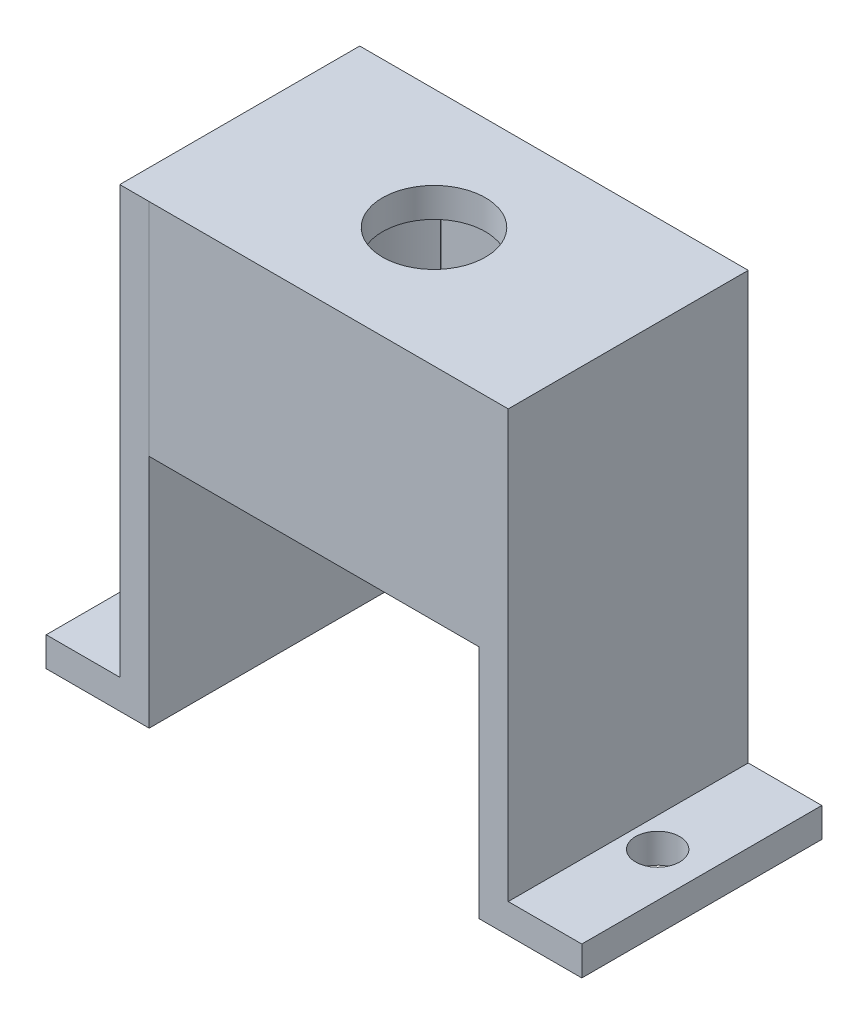
ISO-10303-21;
HEADER;
FILE_DESCRIPTION(('STEP AP214'),'2;1');
FILE_NAME('part.step','',(''),(''),'','','');
FILE_SCHEMA(('AUTOMOTIVE_DESIGN { 1 0 10303 214 1 1 1 1 }'));
ENDSEC;
DATA;
#1=APPLICATION_CONTEXT('core data for automotive mechanical design processes');
#2=APPLICATION_PROTOCOL_DEFINITION('international standard','automotive_design',2000,#1);
#3=PRODUCT_CONTEXT('',#1,'mechanical');
#4=PRODUCT('Part','Part','',(#3));
#5=PRODUCT_RELATED_PRODUCT_CATEGORY('part','',(#4));
#6=PRODUCT_DEFINITION_FORMATION('','',#4);
#7=PRODUCT_DEFINITION_CONTEXT('part definition',#1,'design');
#8=PRODUCT_DEFINITION('design','',#6,#7);
#9=PRODUCT_DEFINITION_SHAPE('','',#8);
#10=(LENGTH_UNIT() NAMED_UNIT(*) SI_UNIT(.MILLI.,.METRE.));
#11=(NAMED_UNIT(*) PLANE_ANGLE_UNIT() SI_UNIT($,.RADIAN.));
#12=(NAMED_UNIT(*) SI_UNIT($,.STERADIAN.) SOLID_ANGLE_UNIT());
#13=UNCERTAINTY_MEASURE_WITH_UNIT(LENGTH_MEASURE(1.E-05),#10,'distance_accuracy_value','');
#14=(GEOMETRIC_REPRESENTATION_CONTEXT(3) GLOBAL_UNCERTAINTY_ASSIGNED_CONTEXT((#13)) GLOBAL_UNIT_ASSIGNED_CONTEXT((#10,
#11,#12)) REPRESENTATION_CONTEXT('',''));
#15=CARTESIAN_POINT('',(0.,0.,0.));
#16=DIRECTION('',(0.,0.,1.));
#17=DIRECTION('',(1.,0.,0.));
#18=AXIS2_PLACEMENT_3D('',#15,#16,#17);
#19=CARTESIAN_POINT('',(-28.4728795445072,-3.,0.));
#20=DIRECTION('',(1.,0.,0.));
#21=DIRECTION('',(0.,0.,-1.));
#22=AXIS2_PLACEMENT_3D('',#19,#20,#21);
#23=PLANE('',#22);
#24=DIRECTION('',(0.,1.,0.));
#25=VECTOR('',#24,1.);
#26=CARTESIAN_POINT('',(-28.4728795445072,12.,6.36945204504964));
#27=LINE('',#26,#25);
#28=CARTESIAN_POINT('',(-28.4728795445072,-3.,6.36945204504964));
#29=VERTEX_POINT('',#28);
#30=CARTESIAN_POINT('',(-28.4728795445072,12.,6.36945204504964));
#31=VERTEX_POINT('',#30);
#32=EDGE_CURVE('E11',#29,#31,#27,.T.);
#33=ORIENTED_EDGE('',*,*,#32,.F.);
#34=DIRECTION('',(0.,0.,-1.));
#35=VECTOR('',#34,1.);
#36=CARTESIAN_POINT('',(-28.4728795445072,-3.,0.));
#37=LINE('',#36,#35);
#38=CARTESIAN_POINT('',(-28.4728795445072,-3.,6.37159662315022));
#39=VERTEX_POINT('',#38);
#40=EDGE_CURVE('E509',#39,#29,#37,.T.);
#41=ORIENTED_EDGE('',*,*,#40,.F.);
#42=DIRECTION('',(0.,1.,0.));
#43=VECTOR('',#42,1.);
#44=CARTESIAN_POINT('',(-28.4728795445072,-3.,6.37159662315022));
#45=LINE('',#44,#43);
#46=CARTESIAN_POINT('',(-28.4728795445072,12.,6.37159662315022));
#47=VERTEX_POINT('',#46);
#48=EDGE_CURVE('E519',#39,#47,#45,.T.);
#49=ORIENTED_EDGE('',*,*,#48,.T.);
#50=DIRECTION('',(0.,0.,-1.));
#51=VECTOR('',#50,1.);
#52=CARTESIAN_POINT('',(-28.4728795445072,12.,0.));
#53=LINE('',#52,#51);
#54=EDGE_CURVE('E532',#47,#31,#53,.T.);
#55=ORIENTED_EDGE('',*,*,#54,.T.);
#56=EDGE_LOOP('',(#33,#41,#49,#55));
#57=FACE_BOUND('',#56,.T.);
#58=ADVANCED_FACE('F47',(#57),#23,.F.);
#59=CARTESIAN_POINT('',(0.,0.,0.));
#60=DIRECTION('',(0.,1.,0.));
#61=DIRECTION('',(0.,0.,1.));
#62=AXIS2_PLACEMENT_3D('',#59,#60,#61);
#63=PLANE('',#62);
#64=CARTESIAN_POINT('',(-10.280448772951,0.,5.75981248715435));
#65=DIRECTION('',(0.,1.,0.));
#66=DIRECTION('',(0.,0.,1.));
#67=AXIS2_PLACEMENT_3D('',#64,#65,#66);
#68=CIRCLE('',#67,0.000681012910450294);
#69=CARTESIAN_POINT('',(-10.2809178123792,0.,5.75931874572508));
#70=VERTEX_POINT('',#69);
#71=CARTESIAN_POINT('',(-10.2811297856983,0.,5.75981201587057));
#72=VERTEX_POINT('',#71);
#73=EDGE_CURVE('E411',#70,#72,#68,.T.);
#74=ORIENTED_EDGE('',*,*,#73,.F.);
#75=CARTESIAN_POINT('',(-17.4169270645186,0.,-1.7525090358387));
#76=DIRECTION('',(0.,1.,0.));
#77=DIRECTION('',(0.,0.,1.));
#78=AXIS2_PLACEMENT_3D('',#75,#76,#77);
#79=CIRCLE('',#78,10.3609934208305);
#80=CARTESIAN_POINT('',(-10.2803968165551,0.,5.75882378107173));
#81=VERTEX_POINT('',#80);
#82=EDGE_CURVE('E368',#70,#81,#79,.T.);
#83=ORIENTED_EDGE('',*,*,#82,.T.);
#84=CARTESIAN_POINT('',(-10.2710154859666,0.,5.75981248715435));
#85=DIRECTION('',(0.,1.,0.));
#86=DIRECTION('',(0.,0.,1.));
#87=AXIS2_PLACEMENT_3D('',#84,#85,#86);
#88=CIRCLE('',#87,0.00943328698438707);
#89=CARTESIAN_POINT('',(-10.280448772951,0.,5.75981248715435));
#90=VERTEX_POINT('',#89);
#91=EDGE_CURVE('E512',#81,#90,#88,.T.);
#92=ORIENTED_EDGE('',*,*,#91,.T.);
#93=DIRECTION('',(1.,0.,0.));
#94=VECTOR('',#93,1.);
#95=CARTESIAN_POINT('',(0.,0.,5.75981248715435));
#96=LINE('',#95,#94);
#97=EDGE_CURVE('E469',#72,#90,#96,.T.);
#98=ORIENTED_EDGE('',*,*,#97,.F.);
#99=EDGE_LOOP('',(#74,#83,#92,#98));
#100=FACE_BOUND('',#99,.T.);
#101=ADVANCED_FACE('F647',(#100),#63,.F.);
#102=CARTESIAN_POINT('',(0.,12.,0.));
#103=DIRECTION('',(0.,1.,0.));
#104=DIRECTION('',(0.,0.,1.));
#105=AXIS2_PLACEMENT_3D('',#102,#103,#104);
#106=PLANE('',#105);
#107=CARTESIAN_POINT('',(-17.2694265241894,12.,-1.78447566590007));
#108=DIRECTION('',(0.,1.,0.));
#109=DIRECTION('',(0.,0.,1.));
#110=AXIS2_PLACEMENT_3D('',#107,#108,#109);
#111=CIRCLE('',#110,3.5);
#112=CARTESIAN_POINT('',(-17.2694265241894,12.,1.71552433409993));
#113=VERTEX_POINT('',#112);
#114=EDGE_CURVE('E249',#113,#113,#111,.T.);
#115=ORIENTED_EDGE('',*,*,#114,.F.);
#116=EDGE_LOOP('',(#115));
#117=FACE_BOUND('',#116,.T.);
#118=DIRECTION('',(1.,0.,0.));
#119=VECTOR('',#118,1.);
#120=CARTESIAN_POINT('',(0.,12.,6.37159662315022));
#121=LINE('',#120,#119);
#122=CARTESIAN_POINT('',(-4.06597350387149,12.,6.37159662315022));
#123=VERTEX_POINT('',#122);
#124=EDGE_CURVE('E442',#47,#123,#121,.T.);
#125=ORIENTED_EDGE('',*,*,#124,.T.);
#126=DIRECTION('',(0.,0.,1.));
#127=VECTOR('',#126,1.);
#128=CARTESIAN_POINT('',(-4.06597350387149,12.,6.37159662315022));
#129=LINE('',#128,#127);
#130=CARTESIAN_POINT('',(-4.06597350387149,12.,-9.94054795495036));
#131=VERTEX_POINT('',#130);
#132=EDGE_CURVE('E316',#131,#123,#129,.T.);
#133=ORIENTED_EDGE('',*,*,#132,.F.);
#134=DIRECTION('',(1.,0.,0.));
#135=VECTOR('',#134,1.);
#136=CARTESIAN_POINT('',(0.,12.,-9.94054795495036));
#137=LINE('',#136,#135);
#138=CARTESIAN_POINT('',(-30.4728795445072,12.,-9.94054795495036));
#139=VERTEX_POINT('',#138);
#140=EDGE_CURVE('E588',#139,#131,#137,.T.);
#141=ORIENTED_EDGE('',*,*,#140,.F.);
#142=DIRECTION('',(0.,0.,-1.));
#143=VECTOR('',#142,1.);
#144=CARTESIAN_POINT('',(-30.4728795445072,12.,-9.94054795495036));
#145=LINE('',#144,#143);
#146=CARTESIAN_POINT('',(-30.4728795445072,12.,6.36945204504964));
#147=VERTEX_POINT('',#146);
#148=EDGE_CURVE('E342',#147,#139,#145,.T.);
#149=ORIENTED_EDGE('',*,*,#148,.F.);
#150=DIRECTION('',(1.,0.,0.));
#151=VECTOR('',#150,1.);
#152=CARTESIAN_POINT('',(-30.4728795445072,12.,6.36945204504964));
#153=LINE('',#152,#151);
#154=EDGE_CURVE('E346',#147,#31,#153,.T.);
#155=ORIENTED_EDGE('',*,*,#154,.T.);
#156=ORIENTED_EDGE('',*,*,#54,.F.);
#157=EDGE_LOOP('',(#125,#133,#141,#149,#155,#156));
#158=FACE_BOUND('',#157,.T.);
#159=ADVANCED_FACE('F600',(#117,#158),#106,.T.);
#160=CARTESIAN_POINT('',(-10.2710154859666,-3.,5.75981248715435));
#161=DIRECTION('',(0.,1.,0.));
#162=DIRECTION('',(0.,0.,1.));
#163=AXIS2_PLACEMENT_3D('',#160,#161,#162);
#164=CYLINDRICAL_SURFACE('',#163,0.00943328698438707);
#165=DIRECTION('',(0.,1.,0.));
#166=VECTOR('',#165,1.);
#167=CARTESIAN_POINT('',(-10.280448772951,-3.,5.75981248715435));
#168=LINE('',#167,#166);
#169=CARTESIAN_POINT('',(-10.280448772951,-3.,5.75981248715435));
#170=VERTEX_POINT('',#169);
#171=EDGE_CURVE('E503',#170,#90,#168,.T.);
#172=ORIENTED_EDGE('',*,*,#171,.T.);
#173=ORIENTED_EDGE('',*,*,#91,.F.);
#174=CARTESIAN_POINT('',(-10.2776048785716,0.,5.75306216801915));
#175=VERTEX_POINT('',#174);
#176=EDGE_CURVE('E510',#175,#81,#88,.T.);
#177=ORIENTED_EDGE('',*,*,#176,.F.);
#178=DIRECTION('',(0.,1.,0.));
#179=VECTOR('',#178,1.);
#180=CARTESIAN_POINT('',(-10.2776048785716,-3.,5.75306216801915));
#181=LINE('',#180,#179);
#182=CARTESIAN_POINT('',(-10.2776048785716,-3.,5.75306216801915));
#183=VERTEX_POINT('',#182);
#184=EDGE_CURVE('E523',#183,#175,#181,.T.);
#185=ORIENTED_EDGE('',*,*,#184,.F.);
#186=CARTESIAN_POINT('',(-10.2710154859666,-3.,5.75981248715435));
#187=DIRECTION('',(0.,1.,0.));
#188=DIRECTION('',(0.,0.,1.));
#189=AXIS2_PLACEMENT_3D('',#186,#187,#188);
#190=CIRCLE('',#189,0.00943328698438707);
#191=EDGE_CURVE('E554',#170,#183,#190,.F.);
#192=ORIENTED_EDGE('',*,*,#191,.F.);
#193=EDGE_LOOP('',(#172,#173,#177,#185,#192));
#194=FACE_BOUND('',#193,.T.);
#195=ADVANCED_FACE('F552',(#194),#164,.T.);
#196=CARTESIAN_POINT('',(-17.5943756456062,-3.,-1.74239920107681));
#197=DIRECTION('',(0.,1.,0.));
#198=DIRECTION('',(0.,0.,1.));
#199=AXIS2_PLACEMENT_3D('',#196,#197,#198);
#200=CYLINDRICAL_SURFACE('',#199,10.4745919057948);
#201=ORIENTED_EDGE('',*,*,#184,.T.);
#202=CARTESIAN_POINT('',(-17.5943756456062,0.,-1.74239920107681));
#203=DIRECTION('',(0.,1.,0.));
#204=DIRECTION('',(0.,0.,1.));
#205=AXIS2_PLACEMENT_3D('',#202,#203,#204);
#206=CIRCLE('',#205,10.4745919057948);
#207=CARTESIAN_POINT('',(-10.273080285058,0.,-9.23344117376381));
#208=VERTEX_POINT('',#207);
#209=EDGE_CURVE('E457',#175,#208,#206,.T.);
#210=ORIENTED_EDGE('',*,*,#209,.T.);
#211=DIRECTION('',(0.,1.,0.));
#212=VECTOR('',#211,1.);
#213=CARTESIAN_POINT('',(-10.273080285058,-3.,-9.23344117376381));
#214=LINE('',#213,#212);
#215=CARTESIAN_POINT('',(-10.273080285058,-3.,-9.23344117376381));
#216=VERTEX_POINT('',#215);
#217=EDGE_CURVE('E501',#216,#208,#214,.T.);
#218=ORIENTED_EDGE('',*,*,#217,.F.);
#219=CARTESIAN_POINT('',(-17.5943756456062,-3.,-1.74239920107681));
#220=DIRECTION('',(0.,1.,0.));
#221=DIRECTION('',(0.,0.,1.));
#222=AXIS2_PLACEMENT_3D('',#219,#220,#221);
#223=CIRCLE('',#222,10.4745919057948);
#224=EDGE_CURVE('E547',#183,#216,#223,.T.);
#225=ORIENTED_EDGE('',*,*,#224,.F.);
#226=EDGE_LOOP('',(#201,#210,#218,#225));
#227=FACE_BOUND('',#226,.T.);
#228=ADVANCED_FACE('F546',(#227),#200,.F.);
#229=CARTESIAN_POINT('',(-0.00193654345881467,-3.,-9.23559485379658));
#230=DIRECTION('',(-0.000209682586438576,0.,-0.999999978016606));
#231=DIRECTION('',(-0.999999978016606,0.,0.000209682586438576));
#232=AXIS2_PLACEMENT_3D('',#229,#230,#231);
#233=PLANE('',#232);
#234=ORIENTED_EDGE('',*,*,#217,.T.);
#235=DIRECTION('',(0.999999978016606,0.,-0.000209682586438576));
#236=VECTOR('',#235,1.);
#237=CARTESIAN_POINT('',(-0.00193654345881467,0.,-9.23559485379658));
#238=LINE('',#237,#236);
#239=CARTESIAN_POINT('',(-24.2455208864717,0.,-9.23051389621505));
#240=VERTEX_POINT('',#239);
#241=EDGE_CURVE('E452',#240,#208,#238,.T.);
#242=ORIENTED_EDGE('',*,*,#241,.F.);
#243=CARTESIAN_POINT('',(-24.2700173864249,0.,-9.23050625972566));
#244=VERTEX_POINT('',#243);
#245=EDGE_CURVE('E456',#244,#240,#238,.T.);
#246=ORIENTED_EDGE('',*,*,#245,.F.);
#247=DIRECTION('',(0.,1.,0.));
#248=VECTOR('',#247,1.);
#249=CARTESIAN_POINT('',(-24.2700173864249,-3.,-9.23050625972566));
#250=LINE('',#249,#248);
#251=CARTESIAN_POINT('',(-24.2700173864249,-3.,-9.23050625972566));
#252=VERTEX_POINT('',#251);
#253=EDGE_CURVE('E496',#252,#244,#250,.T.);
#254=ORIENTED_EDGE('',*,*,#253,.F.);
#255=DIRECTION('',(-0.999999978016606,0.,0.000209682586438576));
#256=VECTOR('',#255,1.);
#257=CARTESIAN_POINT('',(-0.00193654345881467,-3.,-9.23559485379658));
#258=LINE('',#257,#256);
#259=EDGE_CURVE('E544',#216,#252,#258,.T.);
#260=ORIENTED_EDGE('',*,*,#259,.F.);
#261=EDGE_LOOP('',(#234,#242,#246,#254,#260));
#262=FACE_BOUND('',#261,.T.);
#263=ADVANCED_FACE('F540',(#262),#233,.F.);
#264=CARTESIAN_POINT('',(-17.4292056032931,-3.,-1.74018751284565));
#265=DIRECTION('',(0.,1.,0.));
#266=DIRECTION('',(0.,0.,1.));
#267=AXIS2_PLACEMENT_3D('',#264,#265,#266);
#268=CYLINDRICAL_SURFACE('',#267,10.1440416394106);
#269=ORIENTED_EDGE('',*,*,#253,.T.);
#270=CARTESIAN_POINT('',(-17.4292056032931,0.,-1.74018751284565));
#271=DIRECTION('',(0.,1.,0.));
#272=DIRECTION('',(0.,0.,1.));
#273=AXIS2_PLACEMENT_3D('',#270,#271,#272);
#274=CIRCLE('',#273,10.1440416394106);
#275=CARTESIAN_POINT('',(-24.2700173864248,0.,5.75013123403436));
#276=VERTEX_POINT('',#275);
#277=EDGE_CURVE('E463',#244,#276,#274,.T.);
#278=ORIENTED_EDGE('',*,*,#277,.T.);
#279=DIRECTION('',(0.,1.,0.));
#280=VECTOR('',#279,1.);
#281=CARTESIAN_POINT('',(-24.2700173864248,-3.,5.75013123403436));
#282=LINE('',#281,#280);
#283=CARTESIAN_POINT('',(-24.2700173864248,-3.,5.75013123403436));
#284=VERTEX_POINT('',#283);
#285=EDGE_CURVE('E491',#284,#276,#282,.T.);
#286=ORIENTED_EDGE('',*,*,#285,.F.);
#287=CARTESIAN_POINT('',(-17.4292056032931,-3.,-1.74018751284565));
#288=DIRECTION('',(0.,1.,0.));
#289=DIRECTION('',(0.,0.,1.));
#290=AXIS2_PLACEMENT_3D('',#287,#288,#289);
#291=CIRCLE('',#290,10.1440416394106);
#292=EDGE_CURVE('E561',#252,#284,#291,.T.);
#293=ORIENTED_EDGE('',*,*,#292,.F.);
#294=EDGE_LOOP('',(#269,#278,#286,#293));
#295=FACE_BOUND('',#294,.T.);
#296=ADVANCED_FACE('F665',(#295),#268,.F.);
#297=CARTESIAN_POINT('',(-24.2788591503947,-3.,5.75981248715435));
#298=DIRECTION('',(0.,1.,0.));
#299=DIRECTION('',(0.,0.,1.));
#300=AXIS2_PLACEMENT_3D('',#297,#298,#299);
#301=CYLINDRICAL_SURFACE('',#300,0.0131111956766548);
#302=ORIENTED_EDGE('',*,*,#285,.T.);
#303=CARTESIAN_POINT('',(-24.2788591503947,0.,5.75981248715435));
#304=DIRECTION('',(0.,1.,0.));
#305=DIRECTION('',(0.,0.,1.));
#306=AXIS2_PLACEMENT_3D('',#303,#304,#305);
#307=CIRCLE('',#306,0.0131111956766548);
#308=CARTESIAN_POINT('',(-24.265747954718,0.,5.75981248715435));
#309=VERTEX_POINT('',#308);
#310=EDGE_CURVE('E467',#309,#276,#307,.T.);
#311=ORIENTED_EDGE('',*,*,#310,.F.);
#312=DIRECTION('',(0.,1.,0.));
#313=VECTOR('',#312,1.);
#314=CARTESIAN_POINT('',(-24.265747954718,-3.,5.75981248715435));
#315=LINE('',#314,#313);
#316=CARTESIAN_POINT('',(-24.265747954718,-3.,5.75981248715435));
#317=VERTEX_POINT('',#316);
#318=EDGE_CURVE('E483',#317,#309,#315,.T.);
#319=ORIENTED_EDGE('',*,*,#318,.F.);
#320=CARTESIAN_POINT('',(-24.2788591503947,-3.,5.75981248715435));
#321=DIRECTION('',(0.,1.,0.));
#322=DIRECTION('',(0.,0.,1.));
#323=AXIS2_PLACEMENT_3D('',#320,#321,#322);
#324=CIRCLE('',#323,0.0131111956766548);
#325=EDGE_CURVE('E492',#284,#317,#324,.F.);
#326=ORIENTED_EDGE('',*,*,#325,.F.);
#327=EDGE_LOOP('',(#302,#311,#319,#326));
#328=FACE_BOUND('',#327,.T.);
#329=ADVANCED_FACE('F488',(#328),#301,.T.);
#330=CARTESIAN_POINT('',(0.,-3.,5.75981248715435));
#331=DIRECTION('',(0.,0.,1.));
#332=DIRECTION('',(1.,0.,0.));
#333=AXIS2_PLACEMENT_3D('',#330,#331,#332);
#334=PLANE('',#333);
#335=ORIENTED_EDGE('',*,*,#318,.T.);
#336=EDGE_CURVE('E57',#309,#72,#96,.T.);
#337=ORIENTED_EDGE('',*,*,#336,.T.);
#338=ORIENTED_EDGE('',*,*,#97,.T.);
#339=ORIENTED_EDGE('',*,*,#171,.F.);
#340=DIRECTION('',(1.,0.,0.));
#341=VECTOR('',#340,1.);
#342=CARTESIAN_POINT('',(0.,-3.,5.75981248715435));
#343=LINE('',#342,#341);
#344=EDGE_CURVE('E555',#317,#170,#343,.T.);
#345=ORIENTED_EDGE('',*,*,#344,.F.);
#346=EDGE_LOOP('',(#335,#337,#338,#339,#345));
#347=FACE_BOUND('',#346,.T.);
#348=ADVANCED_FACE('F480',(#347),#334,.F.);
#349=CARTESIAN_POINT('',(0.,-3.,6.37159662315022));
#350=DIRECTION('',(0.,0.,1.));
#351=DIRECTION('',(1.,0.,0.));
#352=AXIS2_PLACEMENT_3D('',#349,#350,#351);
#353=PLANE('',#352);
#354=ORIENTED_EDGE('',*,*,#124,.F.);
#355=ORIENTED_EDGE('',*,*,#48,.F.);
#356=DIRECTION('',(1.,0.,0.));
#357=VECTOR('',#356,1.);
#358=CARTESIAN_POINT('',(0.,-3.,6.37159662315022));
#359=LINE('',#358,#357);
#360=CARTESIAN_POINT('',(-6.06597350387149,-3.,6.37159662315022));
#361=VERTEX_POINT('',#360);
#362=EDGE_CURVE('E572',#39,#361,#359,.T.);
#363=ORIENTED_EDGE('',*,*,#362,.T.);
#364=DIRECTION('',(0.,-1.,0.));
#365=VECTOR('',#364,1.);
#366=CARTESIAN_POINT('',(-6.06597350387149,12.,6.37159662315022));
#367=LINE('',#366,#365);
#368=CARTESIAN_POINT('',(-6.06597350387149,-19.,6.37159662315022));
#369=VERTEX_POINT('',#368);
#370=EDGE_CURVE('E308',#361,#369,#367,.T.);
#371=ORIENTED_EDGE('',*,*,#370,.T.);
#372=DIRECTION('',(-1.,0.,0.));
#373=VECTOR('',#372,1.);
#374=CARTESIAN_POINT('',(-4.06597350387149,-19.,6.37159662315022));
#375=LINE('',#374,#373);
#376=CARTESIAN_POINT('',(0.934026496128512,-19.,6.37159662315022));
#377=VERTEX_POINT('',#376);
#378=EDGE_CURVE('E332',#377,#369,#375,.T.);
#379=ORIENTED_EDGE('',*,*,#378,.F.);
#380=DIRECTION('',(0.,-1.,0.));
#381=VECTOR('',#380,1.);
#382=CARTESIAN_POINT('',(0.934026496128512,-19.,6.37159662315022));
#383=LINE('',#382,#381);
#384=CARTESIAN_POINT('',(0.934026496128512,-17.,6.37159662315022));
#385=VERTEX_POINT('',#384);
#386=EDGE_CURVE('E284',#385,#377,#383,.T.);
#387=ORIENTED_EDGE('',*,*,#386,.F.);
#388=DIRECTION('',(-1.,0.,0.));
#389=VECTOR('',#388,1.);
#390=CARTESIAN_POINT('',(0.934026496128512,-17.,6.37159662315022));
#391=LINE('',#390,#389);
#392=CARTESIAN_POINT('',(-4.06597350387149,-17.,6.37159662315022));
#393=VERTEX_POINT('',#392);
#394=EDGE_CURVE('E298',#385,#393,#391,.T.);
#395=ORIENTED_EDGE('',*,*,#394,.T.);
#396=DIRECTION('',(0.,-1.,0.));
#397=VECTOR('',#396,1.);
#398=CARTESIAN_POINT('',(-4.06597350387149,12.,6.37159662315022));
#399=LINE('',#398,#397);
#400=EDGE_CURVE('E309',#123,#393,#399,.T.);
#401=ORIENTED_EDGE('',*,*,#400,.F.);
#402=EDGE_LOOP('',(#354,#355,#363,#371,#379,#387,#395,#401));
#403=FACE_BOUND('',#402,.T.);
#404=ADVANCED_FACE('F619',(#403),#353,.T.);
#405=CARTESIAN_POINT('',(0.,-3.,-9.94054795495036));
#406=DIRECTION('',(0.,0.,1.));
#407=DIRECTION('',(1.,0.,0.));
#408=AXIS2_PLACEMENT_3D('',#405,#406,#407);
#409=PLANE('',#408);
#410=ORIENTED_EDGE('',*,*,#140,.T.);
#411=DIRECTION('',(0.,1.,0.));
#412=VECTOR('',#411,1.);
#413=CARTESIAN_POINT('',(-4.06597350387149,12.,-9.94054795495036));
#414=LINE('',#413,#412);
#415=CARTESIAN_POINT('',(-4.06597350387149,-17.,-9.94054795495036));
#416=VERTEX_POINT('',#415);
#417=EDGE_CURVE('E312',#416,#131,#414,.T.);
#418=ORIENTED_EDGE('',*,*,#417,.F.);
#419=DIRECTION('',(-1.,0.,0.));
#420=VECTOR('',#419,1.);
#421=CARTESIAN_POINT('',(0.934026496128512,-17.,-9.94054795495036));
#422=LINE('',#421,#420);
#423=CARTESIAN_POINT('',(0.934026496128512,-17.,-9.94054795495036));
#424=VERTEX_POINT('',#423);
#425=EDGE_CURVE('E304',#424,#416,#422,.T.);
#426=ORIENTED_EDGE('',*,*,#425,.F.);
#427=DIRECTION('',(0.,1.,0.));
#428=VECTOR('',#427,1.);
#429=CARTESIAN_POINT('',(0.934026496128512,-19.,-9.94054795495036));
#430=LINE('',#429,#428);
#431=CARTESIAN_POINT('',(0.934026496128512,-19.,-9.94054795495036));
#432=VERTEX_POINT('',#431);
#433=EDGE_CURVE('E292',#432,#424,#430,.T.);
#434=ORIENTED_EDGE('',*,*,#433,.F.);
#435=DIRECTION('',(-1.,0.,0.));
#436=VECTOR('',#435,1.);
#437=CARTESIAN_POINT('',(-4.06597350387149,-19.,-9.94054795495036));
#438=LINE('',#437,#436);
#439=CARTESIAN_POINT('',(-6.06597350387149,-19.,-9.94054795495036));
#440=VERTEX_POINT('',#439);
#441=EDGE_CURVE('E320',#432,#440,#438,.T.);
#442=ORIENTED_EDGE('',*,*,#441,.T.);
#443=DIRECTION('',(0.,1.,0.));
#444=VECTOR('',#443,1.);
#445=CARTESIAN_POINT('',(-6.06597350387149,12.,-9.94054795495036));
#446=LINE('',#445,#444);
#447=CARTESIAN_POINT('',(-6.06597350387149,-3.,-9.94054795495036));
#448=VERTEX_POINT('',#447);
#449=EDGE_CURVE('E313',#440,#448,#446,.T.);
#450=ORIENTED_EDGE('',*,*,#449,.T.);
#451=DIRECTION('',(1.,0.,0.));
#452=VECTOR('',#451,1.);
#453=CARTESIAN_POINT('',(0.,-3.,-9.94054795495036));
#454=LINE('',#453,#452);
#455=CARTESIAN_POINT('',(-28.4728795445072,-3.,-9.94054795495036));
#456=VERTEX_POINT('',#455);
#457=EDGE_CURVE('E580',#456,#448,#454,.T.);
#458=ORIENTED_EDGE('',*,*,#457,.F.);
#459=DIRECTION('',(0.,-1.,0.));
#460=VECTOR('',#459,1.);
#461=CARTESIAN_POINT('',(-28.4728795445072,12.,-9.94054795495036));
#462=LINE('',#461,#460);
#463=CARTESIAN_POINT('',(-28.4728795445072,-19.,-9.94054795495036));
#464=VERTEX_POINT('',#463);
#465=EDGE_CURVE('E245',#456,#464,#462,.T.);
#466=ORIENTED_EDGE('',*,*,#465,.T.);
#467=DIRECTION('',(1.,0.,0.));
#468=VECTOR('',#467,1.);
#469=CARTESIAN_POINT('',(-30.4728795445072,-19.,-9.94054795495036));
#470=LINE('',#469,#468);
#471=CARTESIAN_POINT('',(-35.4728795445072,-19.,-9.94054795495036));
#472=VERTEX_POINT('',#471);
#473=EDGE_CURVE('E236',#472,#464,#470,.T.);
#474=ORIENTED_EDGE('',*,*,#473,.F.);
#475=DIRECTION('',(0.,-1.,0.));
#476=VECTOR('',#475,1.);
#477=CARTESIAN_POINT('',(-35.4728795445072,-19.,-9.94054795495036));
#478=LINE('',#477,#476);
#479=CARTESIAN_POINT('',(-35.4728795445072,-17.,-9.94054795495036));
#480=VERTEX_POINT('',#479);
#481=EDGE_CURVE('E242',#480,#472,#478,.T.);
#482=ORIENTED_EDGE('',*,*,#481,.F.);
#483=DIRECTION('',(1.,0.,0.));
#484=VECTOR('',#483,1.);
#485=CARTESIAN_POINT('',(-35.4728795445072,-17.,-9.94054795495036));
#486=LINE('',#485,#484);
#487=CARTESIAN_POINT('',(-30.4728795445072,-17.,-9.94054795495036));
#488=VERTEX_POINT('',#487);
#489=EDGE_CURVE('E276',#480,#488,#486,.T.);
#490=ORIENTED_EDGE('',*,*,#489,.T.);
#491=DIRECTION('',(0.,-1.,0.));
#492=VECTOR('',#491,1.);
#493=CARTESIAN_POINT('',(-30.4728795445072,12.,-9.94054795495036));
#494=LINE('',#493,#492);
#495=EDGE_CURVE('E336',#139,#488,#494,.T.);
#496=ORIENTED_EDGE('',*,*,#495,.F.);
#497=EDGE_LOOP('',(#410,#418,#426,#434,#442,#450,#458,#466,#474,#482,#490,#496));
#498=FACE_BOUND('',#497,.T.);
#499=ADVANCED_FACE('F239',(#498),#409,.F.);
#500=CARTESIAN_POINT('',(0.,-3.,0.));
#501=DIRECTION('',(0.,1.,0.));
#502=DIRECTION('',(0.,0.,1.));
#503=AXIS2_PLACEMENT_3D('',#500,#501,#502);
#504=PLANE('',#503);
#505=ORIENTED_EDGE('',*,*,#191,.T.);
#506=ORIENTED_EDGE('',*,*,#224,.T.);
#507=ORIENTED_EDGE('',*,*,#259,.T.);
#508=ORIENTED_EDGE('',*,*,#292,.T.);
#509=ORIENTED_EDGE('',*,*,#325,.T.);
#510=ORIENTED_EDGE('',*,*,#344,.T.);
#511=EDGE_LOOP('',(#505,#506,#507,#508,#509,#510));
#512=FACE_BOUND('',#511,.T.);
#513=ORIENTED_EDGE('',*,*,#362,.F.);
#514=ORIENTED_EDGE('',*,*,#40,.T.);
#515=EDGE_CURVE('E583',#29,#456,#37,.T.);
#516=ORIENTED_EDGE('',*,*,#515,.T.);
#517=ORIENTED_EDGE('',*,*,#457,.T.);
#518=DIRECTION('',(0.,0.,-1.));
#519=VECTOR('',#518,1.);
#520=CARTESIAN_POINT('',(-6.06597350387149,-3.,0.));
#521=LINE('',#520,#519);
#522=EDGE_CURVE('E576',#361,#448,#521,.T.);
#523=ORIENTED_EDGE('',*,*,#522,.F.);
#524=EDGE_LOOP('',(#513,#514,#516,#517,#523));
#525=FACE_BOUND('',#524,.T.);
#526=ADVANCED_FACE('F611',(#512,#525),#504,.F.);
#527=CARTESIAN_POINT('',(-24.2700173864248,0.,5.75013123403436));
#528=DIRECTION('',(0.,1.,0.));
#529=DIRECTION('',(0.,0.,1.));
#530=AXIS2_PLACEMENT_3D('',#527,#528,#529);
#531=CIRCLE('',#530,0.0244965021365407);
#532=CARTESIAN_POINT('',(-24.2455208901541,0.,5.75014818643564));
#533=VERTEX_POINT('',#532);
#534=CARTESIAN_POINT('',(-24.2534977420446,0.,5.73204311731434));
#535=VERTEX_POINT('',#534);
#536=EDGE_CURVE('E402',#533,#535,#531,.T.);
#537=ORIENTED_EDGE('',*,*,#536,.F.);
#538=DIRECTION('',(0.999999760544756,0.,0.000692033547942534));
#539=VECTOR('',#538,1.);
#540=CARTESIAN_POINT('',(-0.00399090593066213,0.,5.76692414245527));
#541=LINE('',#540,#539);
#542=EDGE_CURVE('E407',#533,#72,#541,.T.);
#543=ORIENTED_EDGE('',*,*,#542,.T.);
#544=ORIENTED_EDGE('',*,*,#336,.F.);
#545=ORIENTED_EDGE('',*,*,#310,.T.);
#546=ORIENTED_EDGE('',*,*,#277,.F.);
#547=ORIENTED_EDGE('',*,*,#245,.T.);
#548=CARTESIAN_POINT('',(-24.2700173864249,0.,-9.23050625972566));
#549=DIRECTION('',(0.,1.,0.));
#550=DIRECTION('',(0.,0.,1.));
#551=AXIS2_PLACEMENT_3D('',#548,#549,#550);
#552=CIRCLE('',#551,0.0244965021365407);
#553=CARTESIAN_POINT('',(-24.2534977420446,0.,-9.21241814300565));
#554=VERTEX_POINT('',#553);
#555=EDGE_CURVE('E403',#554,#240,#552,.T.);
#556=ORIENTED_EDGE('',*,*,#555,.F.);
#557=CARTESIAN_POINT('',(-17.4292056032911,0.,-1.74018751284566));
#558=DIRECTION('',(0.,1.,0.));
#559=DIRECTION('',(0.,0.,1.));
#560=AXIS2_PLACEMENT_3D('',#557,#558,#559);
#561=CIRCLE('',#560,10.1195451372754);
#562=EDGE_CURVE('E398',#554,#535,#561,.T.);
#563=ORIENTED_EDGE('',*,*,#562,.T.);
#564=EDGE_LOOP('',(#537,#543,#544,#545,#546,#547,#556,#563));
#565=FACE_BOUND('',#564,.T.);
#566=ADVANCED_FACE('F49',(#565),#63,.F.);
#567=CARTESIAN_POINT('',(0.,0.,0.));
#568=DIRECTION('',(0.,1.,0.));
#569=DIRECTION('',(0.,0.,1.));
#570=AXIS2_PLACEMENT_3D('',#567,#568,#569);
#571=PLANE('',#570);
#572=ORIENTED_EDGE('',*,*,#176,.T.);
#573=CARTESIAN_POINT('',(-10.2611524254198,0.,-9.2455107027892));
#574=VERTEX_POINT('',#573);
#575=EDGE_CURVE('E415',#81,#574,#79,.T.);
#576=ORIENTED_EDGE('',*,*,#575,.T.);
#577=CARTESIAN_POINT('',(-10.2606820868416,0.,-9.24600320680556));
#578=DIRECTION('',(0.,1.,0.));
#579=DIRECTION('',(0.,0.,1.));
#580=AXIS2_PLACEMENT_3D('',#577,#578,#579);
#581=CIRCLE('',#580,0.000681012910449594);
#582=CARTESIAN_POINT('',(-10.2613630993354,0.,-9.24600245347827));
#583=VERTEX_POINT('',#582);
#584=EDGE_CURVE('E393',#583,#574,#581,.T.);
#585=ORIENTED_EDGE('',*,*,#584,.F.);
#586=DIRECTION('',(-0.999999388175525,0.,0.00110618650115007));
#587=VECTOR('',#586,1.);
#588=CARTESIAN_POINT('',(-0.0102403531483553,0.,-9.25734211401961));
#589=LINE('',#588,#587);
#590=EDGE_CURVE('E397',#583,#240,#589,.T.);
#591=ORIENTED_EDGE('',*,*,#590,.T.);
#592=ORIENTED_EDGE('',*,*,#241,.T.);
#593=ORIENTED_EDGE('',*,*,#209,.F.);
#594=EDGE_LOOP('',(#572,#576,#585,#591,#592,#593));
#595=FACE_BOUND('',#594,.T.);
#596=ADVANCED_FACE('F550',(#595),#571,.T.);
#597=CARTESIAN_POINT('',(-10.2606820868416,10.,-9.24600320680556));
#598=DIRECTION('',(0.,-1.,0.));
#599=DIRECTION('',(0.,0.,-1.));
#600=AXIS2_PLACEMENT_3D('',#597,#598,#599);
#601=CYLINDRICAL_SURFACE('',#600,0.000681012910449594);
#602=ORIENTED_EDGE('',*,*,#584,.T.);
#603=DIRECTION('',(0.,-1.,0.));
#604=VECTOR('',#603,1.);
#605=CARTESIAN_POINT('',(-10.2611524254198,10.,-9.2455107027892));
#606=LINE('',#605,#604);
#607=CARTESIAN_POINT('',(-10.2611524254198,10.,-9.2455107027892));
#608=VERTEX_POINT('',#607);
#609=EDGE_CURVE('E392',#608,#574,#606,.T.);
#610=ORIENTED_EDGE('',*,*,#609,.F.);
#611=CARTESIAN_POINT('',(-10.2606820868416,10.,-9.24600320680556));
#612=DIRECTION('',(0.,1.,0.));
#613=DIRECTION('',(0.,0.,1.));
#614=AXIS2_PLACEMENT_3D('',#611,#612,#613);
#615=CIRCLE('',#614,0.000681012910449594);
#616=CARTESIAN_POINT('',(-10.2613630993354,10.,-9.24600245347827));
#617=VERTEX_POINT('',#616);
#618=EDGE_CURVE('E363',#617,#608,#615,.T.);
#619=ORIENTED_EDGE('',*,*,#618,.F.);
#620=DIRECTION('',(0.,-1.,0.));
#621=VECTOR('',#620,1.);
#622=CARTESIAN_POINT('',(-10.2613630993354,10.,-9.24600245347827));
#623=LINE('',#622,#621);
#624=EDGE_CURVE('E439',#617,#583,#623,.T.);
#625=ORIENTED_EDGE('',*,*,#624,.T.);
#626=EDGE_LOOP('',(#602,#610,#619,#625));
#627=FACE_BOUND('',#626,.T.);
#628=ADVANCED_FACE('F878',(#627),#601,.T.);
#629=CARTESIAN_POINT('',(-0.0102403531483553,10.,-9.25734211401961));
#630=DIRECTION('',(0.00110618650115007,0.,0.999999388175525));
#631=DIRECTION('',(0.999999388175525,0.,-0.00110618650115007));
#632=AXIS2_PLACEMENT_3D('',#629,#630,#631);
#633=PLANE('',#632);
#634=ORIENTED_EDGE('',*,*,#590,.F.);
#635=ORIENTED_EDGE('',*,*,#624,.F.);
#636=DIRECTION('',(-0.999999388175525,0.,0.00110618650115007));
#637=VECTOR('',#636,1.);
#638=CARTESIAN_POINT('',(-0.0102403531483553,10.,-9.25734211401961));
#639=LINE('',#638,#637);
#640=CARTESIAN_POINT('',(-24.2455208992759,10.,-9.23053335742565));
#641=VERTEX_POINT('',#640);
#642=EDGE_CURVE('E367',#617,#641,#639,.T.);
#643=ORIENTED_EDGE('',*,*,#642,.T.);
#644=DIRECTION('',(0.,-1.,0.));
#645=VECTOR('',#644,1.);
#646=CARTESIAN_POINT('',(-24.2455208992759,10.,-9.23053335742565));
#647=LINE('',#646,#645);
#648=EDGE_CURVE('E438',#641,#240,#647,.T.);
#649=ORIENTED_EDGE('',*,*,#648,.T.);
#650=EDGE_LOOP('',(#634,#635,#643,#649));
#651=FACE_BOUND('',#650,.T.);
#652=ADVANCED_FACE('F869',(#651),#633,.T.);
#653=CARTESIAN_POINT('',(-24.2700173864249,10.,-9.23050625972566));
#654=DIRECTION('',(0.,-1.,0.));
#655=DIRECTION('',(0.,0.,-1.));
#656=AXIS2_PLACEMENT_3D('',#653,#654,#655);
#657=CYLINDRICAL_SURFACE('',#656,0.0244965021365407);
#658=ORIENTED_EDGE('',*,*,#555,.T.);
#659=ORIENTED_EDGE('',*,*,#648,.F.);
#660=CARTESIAN_POINT('',(-24.2700173864249,10.,-9.23050625972566));
#661=DIRECTION('',(0.,1.,0.));
#662=DIRECTION('',(0.,0.,1.));
#663=AXIS2_PLACEMENT_3D('',#660,#661,#662);
#664=CIRCLE('',#663,0.0244965021365407);
#665=CARTESIAN_POINT('',(-24.2534977420446,10.,-9.21241814300565));
#666=VERTEX_POINT('',#665);
#667=EDGE_CURVE('E371',#666,#641,#664,.T.);
#668=ORIENTED_EDGE('',*,*,#667,.F.);
#669=DIRECTION('',(0.,-1.,0.));
#670=VECTOR('',#669,1.);
#671=CARTESIAN_POINT('',(-24.2534977420446,10.,-9.21241814300565));
#672=LINE('',#671,#670);
#673=EDGE_CURVE('E434',#666,#554,#672,.T.);
#674=ORIENTED_EDGE('',*,*,#673,.T.);
#675=EDGE_LOOP('',(#658,#659,#668,#674));
#676=FACE_BOUND('',#675,.T.);
#677=ADVANCED_FACE('F860',(#676),#657,.T.);
#678=CARTESIAN_POINT('',(-17.4292056032911,10.,-1.74018751284566));
#679=DIRECTION('',(0.,-1.,0.));
#680=DIRECTION('',(0.,0.,-1.));
#681=AXIS2_PLACEMENT_3D('',#678,#679,#680);
#682=CYLINDRICAL_SURFACE('',#681,10.1195451372754);
#683=ORIENTED_EDGE('',*,*,#562,.F.);
#684=ORIENTED_EDGE('',*,*,#673,.F.);
#685=CARTESIAN_POINT('',(-17.4292056032911,10.,-1.74018751284566));
#686=DIRECTION('',(0.,1.,0.));
#687=DIRECTION('',(0.,0.,1.));
#688=AXIS2_PLACEMENT_3D('',#685,#686,#687);
#689=CIRCLE('',#688,10.1195451372754);
#690=CARTESIAN_POINT('',(-24.2534977420446,10.,5.73204311731434));
#691=VERTEX_POINT('',#690);
#692=EDGE_CURVE('E375',#666,#691,#689,.T.);
#693=ORIENTED_EDGE('',*,*,#692,.T.);
#694=DIRECTION('',(0.,-1.,0.));
#695=VECTOR('',#694,1.);
#696=CARTESIAN_POINT('',(-24.2534977420446,10.,5.73204311731434));
#697=LINE('',#696,#695);
#698=EDGE_CURVE('E431',#691,#535,#697,.T.);
#699=ORIENTED_EDGE('',*,*,#698,.T.);
#700=EDGE_LOOP('',(#683,#684,#693,#699));
#701=FACE_BOUND('',#700,.T.);
#702=ADVANCED_FACE('F851',(#701),#682,.F.);
#703=CARTESIAN_POINT('',(-24.2700173864248,10.,5.75013123403436));
#704=DIRECTION('',(0.,-1.,0.));
#705=DIRECTION('',(0.,0.,-1.));
#706=AXIS2_PLACEMENT_3D('',#703,#704,#705);
#707=CYLINDRICAL_SURFACE('',#706,0.0244965021365407);
#708=ORIENTED_EDGE('',*,*,#536,.T.);
#709=ORIENTED_EDGE('',*,*,#698,.F.);
#710=CARTESIAN_POINT('',(-24.2700173864248,10.,5.75013123403436));
#711=DIRECTION('',(0.,1.,0.));
#712=DIRECTION('',(0.,0.,1.));
#713=AXIS2_PLACEMENT_3D('',#710,#711,#712);
#714=CIRCLE('',#713,0.0244965021365407);
#715=CARTESIAN_POINT('',(-24.2455208901541,10.,5.75014818643564));
#716=VERTEX_POINT('',#715);
#717=EDGE_CURVE('E378',#716,#691,#714,.T.);
#718=ORIENTED_EDGE('',*,*,#717,.F.);
#719=DIRECTION('',(0.,-1.,0.));
#720=VECTOR('',#719,1.);
#721=CARTESIAN_POINT('',(-24.2455208901541,10.,5.75014818643564));
#722=LINE('',#721,#720);
#723=EDGE_CURVE('E428',#716,#533,#722,.T.);
#724=ORIENTED_EDGE('',*,*,#723,.T.);
#725=EDGE_LOOP('',(#708,#709,#718,#724));
#726=FACE_BOUND('',#725,.T.);
#727=ADVANCED_FACE('F842',(#726),#707,.T.);
#728=CARTESIAN_POINT('',(-0.00399090593066213,10.,5.76692414245527));
#729=DIRECTION('',(0.000692033547942533,0.,-0.999999760544756));
#730=DIRECTION('',(-0.999999760544756,0.,-0.000692033547942533));
#731=AXIS2_PLACEMENT_3D('',#728,#729,#730);
#732=PLANE('',#731);
#733=ORIENTED_EDGE('',*,*,#542,.F.);
#734=ORIENTED_EDGE('',*,*,#723,.F.);
#735=DIRECTION('',(0.999999760544756,0.,0.000692033547942534));
#736=VECTOR('',#735,1.);
#737=CARTESIAN_POINT('',(-0.00399090593066213,10.,5.76692414245527));
#738=LINE('',#737,#736);
#739=CARTESIAN_POINT('',(-10.2811297856983,10.,5.75981201587057));
#740=VERTEX_POINT('',#739);
#741=EDGE_CURVE('E382',#716,#740,#738,.T.);
#742=ORIENTED_EDGE('',*,*,#741,.T.);
#743=DIRECTION('',(0.,-1.,0.));
#744=VECTOR('',#743,1.);
#745=CARTESIAN_POINT('',(-10.2811297856983,10.,5.75981201587057));
#746=LINE('',#745,#744);
#747=EDGE_CURVE('E425',#740,#72,#746,.T.);
#748=ORIENTED_EDGE('',*,*,#747,.T.);
#749=EDGE_LOOP('',(#733,#734,#742,#748));
#750=FACE_BOUND('',#749,.T.);
#751=ADVANCED_FACE('F833',(#750),#732,.T.);
#752=CARTESIAN_POINT('',(-10.280448772951,10.,5.75981248715435));
#753=DIRECTION('',(0.,-1.,0.));
#754=DIRECTION('',(0.,0.,-1.));
#755=AXIS2_PLACEMENT_3D('',#752,#753,#754);
#756=CYLINDRICAL_SURFACE('',#755,0.000681012910450294);
#757=ORIENTED_EDGE('',*,*,#73,.T.);
#758=ORIENTED_EDGE('',*,*,#747,.F.);
#759=CARTESIAN_POINT('',(-10.280448772951,10.,5.75981248715435));
#760=DIRECTION('',(0.,1.,0.));
#761=DIRECTION('',(0.,0.,1.));
#762=AXIS2_PLACEMENT_3D('',#759,#760,#761);
#763=CIRCLE('',#762,0.000681012910450294);
#764=CARTESIAN_POINT('',(-10.2809178123792,10.,5.75931874572508));
#765=VERTEX_POINT('',#764);
#766=EDGE_CURVE('E385',#765,#740,#763,.T.);
#767=ORIENTED_EDGE('',*,*,#766,.F.);
#768=DIRECTION('',(0.,-1.,0.));
#769=VECTOR('',#768,1.);
#770=CARTESIAN_POINT('',(-10.2809178123792,10.,5.75931874572508));
#771=LINE('',#770,#769);
#772=EDGE_CURVE('E422',#765,#70,#771,.T.);
#773=ORIENTED_EDGE('',*,*,#772,.T.);
#774=EDGE_LOOP('',(#757,#758,#767,#773));
#775=FACE_BOUND('',#774,.T.);
#776=ADVANCED_FACE('F824',(#775),#756,.T.);
#777=CARTESIAN_POINT('',(-17.4169270645186,10.,-1.7525090358387));
#778=DIRECTION('',(0.,-1.,0.));
#779=DIRECTION('',(0.,0.,-1.));
#780=AXIS2_PLACEMENT_3D('',#777,#778,#779);
#781=CYLINDRICAL_SURFACE('',#780,10.3609934208305);
#782=ORIENTED_EDGE('',*,*,#82,.F.);
#783=ORIENTED_EDGE('',*,*,#772,.F.);
#784=CARTESIAN_POINT('',(-17.4169270645186,10.,-1.7525090358387));
#785=DIRECTION('',(0.,1.,0.));
#786=DIRECTION('',(0.,0.,1.));
#787=AXIS2_PLACEMENT_3D('',#784,#785,#786);
#788=CIRCLE('',#787,10.3609934208305);
#789=EDGE_CURVE('E389',#765,#608,#788,.T.);
#790=ORIENTED_EDGE('',*,*,#789,.T.);
#791=ORIENTED_EDGE('',*,*,#609,.T.);
#792=ORIENTED_EDGE('',*,*,#575,.F.);
#793=EDGE_LOOP('',(#782,#783,#790,#791,#792));
#794=FACE_BOUND('',#793,.T.);
#795=ADVANCED_FACE('F816',(#794),#781,.F.);
#796=CARTESIAN_POINT('',(0.,10.,0.));
#797=DIRECTION('',(0.,1.,0.));
#798=DIRECTION('',(0.,0.,1.));
#799=AXIS2_PLACEMENT_3D('',#796,#797,#798);
#800=PLANE('',#799);
#801=CARTESIAN_POINT('',(-17.2694265241894,10.,-1.78447566590007));
#802=DIRECTION('',(0.,1.,0.));
#803=DIRECTION('',(0.,0.,1.));
#804=AXIS2_PLACEMENT_3D('',#801,#802,#803);
#805=CIRCLE('',#804,3.5);
#806=CARTESIAN_POINT('',(-17.2694265241894,10.,1.71552433409993));
#807=VERTEX_POINT('',#806);
#808=EDGE_CURVE('E362',#807,#807,#805,.T.);
#809=ORIENTED_EDGE('',*,*,#808,.T.);
#810=EDGE_LOOP('',(#809));
#811=FACE_BOUND('',#810,.T.);
#812=ORIENTED_EDGE('',*,*,#618,.T.);
#813=ORIENTED_EDGE('',*,*,#789,.F.);
#814=ORIENTED_EDGE('',*,*,#766,.T.);
#815=ORIENTED_EDGE('',*,*,#741,.F.);
#816=ORIENTED_EDGE('',*,*,#717,.T.);
#817=ORIENTED_EDGE('',*,*,#692,.F.);
#818=ORIENTED_EDGE('',*,*,#667,.T.);
#819=ORIENTED_EDGE('',*,*,#642,.F.);
#820=EDGE_LOOP('',(#812,#813,#814,#815,#816,#817,#818,#819));
#821=FACE_BOUND('',#820,.T.);
#822=ADVANCED_FACE('F682',(#811,#821),#800,.F.);
#823=CARTESIAN_POINT('',(-17.2694265241894,2.,-1.78447566590007));
#824=DIRECTION('',(0.,1.,0.));
#825=DIRECTION('',(0.,0.,1.));
#826=AXIS2_PLACEMENT_3D('',#823,#824,#825);
#827=CYLINDRICAL_SURFACE('',#826,3.5);
#828=ORIENTED_EDGE('',*,*,#114,.T.);
#829=EDGE_LOOP('',(#828));
#830=FACE_BOUND('',#829,.T.);
#831=ORIENTED_EDGE('',*,*,#808,.F.);
#832=EDGE_LOOP('',(#831));
#833=FACE_BOUND('',#832,.T.);
#834=ADVANCED_FACE('F680',(#830,#833),#827,.F.);
#835=CARTESIAN_POINT('',(-30.4728795445072,-19.,-9.94054795495036));
#836=DIRECTION('',(0.,1.,0.));
#837=DIRECTION('',(0.,0.,1.));
#838=AXIS2_PLACEMENT_3D('',#835,#836,#837);
#839=PLANE('',#838);
#840=CARTESIAN_POINT('',(-32.4728795445072,-19.,-1.78554795495036));
#841=DIRECTION('',(0.,-1.,0.));
#842=DIRECTION('',(0.,0.,-1.));
#843=AXIS2_PLACEMENT_3D('',#840,#841,#842);
#844=CIRCLE('',#843,1.5);
#845=CARTESIAN_POINT('',(-32.4728795445072,-19.,-3.28554795495036));
#846=VERTEX_POINT('',#845);
#847=EDGE_CURVE('E691',#846,#846,#844,.T.);
#848=ORIENTED_EDGE('',*,*,#847,.F.);
#849=EDGE_LOOP('',(#848));
#850=FACE_BOUND('',#849,.T.);
#851=DIRECTION('',(0.,0.,1.));
#852=VECTOR('',#851,1.);
#853=CARTESIAN_POINT('',(-28.4728795445072,-19.,-9.94054795495036));
#854=LINE('',#853,#852);
#855=CARTESIAN_POINT('',(-28.4728795445072,-19.,6.36945204504964));
#856=VERTEX_POINT('',#855);
#857=EDGE_CURVE('E349',#464,#856,#854,.T.);
#858=ORIENTED_EDGE('',*,*,#857,.T.);
#859=DIRECTION('',(1.,0.,0.));
#860=VECTOR('',#859,1.);
#861=CARTESIAN_POINT('',(-30.4728795445072,-19.,6.36945204504964));
#862=LINE('',#861,#860);
#863=CARTESIAN_POINT('',(-35.4728795445072,-19.,6.36945204504964));
#864=VERTEX_POINT('',#863);
#865=EDGE_CURVE('E250',#864,#856,#862,.T.);
#866=ORIENTED_EDGE('',*,*,#865,.F.);
#867=DIRECTION('',(0.,0.,1.));
#868=VECTOR('',#867,1.);
#869=CARTESIAN_POINT('',(-35.4728795445072,-19.,-9.94054795495036));
#870=LINE('',#869,#868);
#871=EDGE_CURVE('E253',#472,#864,#870,.T.);
#872=ORIENTED_EDGE('',*,*,#871,.F.);
#873=ORIENTED_EDGE('',*,*,#473,.T.);
#874=EDGE_LOOP('',(#858,#866,#872,#873));
#875=FACE_BOUND('',#874,.T.);
#876=ADVANCED_FACE('F254',(#850,#875),#839,.F.);
#877=CARTESIAN_POINT('',(-30.4728795445072,12.,6.36945204504964));
#878=DIRECTION('',(0.,0.,-1.));
#879=DIRECTION('',(0.,1.,0.));
#880=AXIS2_PLACEMENT_3D('',#877,#878,#879);
#881=PLANE('',#880);
#882=EDGE_CURVE('E59',#856,#29,#27,.T.);
#883=ORIENTED_EDGE('',*,*,#882,.T.);
#884=ORIENTED_EDGE('',*,*,#32,.T.);
#885=ORIENTED_EDGE('',*,*,#154,.F.);
#886=DIRECTION('',(0.,1.,0.));
#887=VECTOR('',#886,1.);
#888=CARTESIAN_POINT('',(-30.4728795445072,12.,6.36945204504964));
#889=LINE('',#888,#887);
#890=CARTESIAN_POINT('',(-30.4728795445072,-17.,6.36945204504964));
#891=VERTEX_POINT('',#890);
#892=EDGE_CURVE('E339',#891,#147,#889,.T.);
#893=ORIENTED_EDGE('',*,*,#892,.F.);
#894=DIRECTION('',(1.,0.,0.));
#895=VECTOR('',#894,1.);
#896=CARTESIAN_POINT('',(-35.4728795445072,-17.,6.36945204504964));
#897=LINE('',#896,#895);
#898=CARTESIAN_POINT('',(-35.4728795445072,-17.,6.36945204504964));
#899=VERTEX_POINT('',#898);
#900=EDGE_CURVE('E280',#899,#891,#897,.T.);
#901=ORIENTED_EDGE('',*,*,#900,.F.);
#902=DIRECTION('',(0.,1.,0.));
#903=VECTOR('',#902,1.);
#904=CARTESIAN_POINT('',(-35.4728795445072,-19.,6.36945204504964));
#905=LINE('',#904,#903);
#906=EDGE_CURVE('E259',#864,#899,#905,.T.);
#907=ORIENTED_EDGE('',*,*,#906,.F.);
#908=ORIENTED_EDGE('',*,*,#865,.T.);
#909=EDGE_LOOP('',(#883,#884,#885,#893,#901,#907,#908));
#910=FACE_BOUND('',#909,.T.);
#911=ADVANCED_FACE('F597',(#910),#881,.F.);
#912=CARTESIAN_POINT('',(-30.4728795445072,0.,0.));
#913=DIRECTION('',(-1.,0.,0.));
#914=DIRECTION('',(0.,0.,1.));
#915=AXIS2_PLACEMENT_3D('',#912,#913,#914);
#916=PLANE('',#915);
#917=DIRECTION('',(0.,0.,-1.));
#918=VECTOR('',#917,1.);
#919=CARTESIAN_POINT('',(-30.4728795445072,-17.,-9.94054795495036));
#920=LINE('',#919,#918);
#921=EDGE_CURVE('E66',#891,#488,#920,.T.);
#922=ORIENTED_EDGE('',*,*,#921,.F.);
#923=ORIENTED_EDGE('',*,*,#892,.T.);
#924=ORIENTED_EDGE('',*,*,#148,.T.);
#925=ORIENTED_EDGE('',*,*,#495,.T.);
#926=EDGE_LOOP('',(#922,#923,#924,#925));
#927=FACE_BOUND('',#926,.T.);
#928=ADVANCED_FACE('F601',(#927),#916,.T.);
#929=CARTESIAN_POINT('',(-28.4728795445072,0.,0.));
#930=DIRECTION('',(-1.,0.,0.));
#931=DIRECTION('',(0.,0.,1.));
#932=AXIS2_PLACEMENT_3D('',#929,#930,#931);
#933=PLANE('',#932);
#934=ORIENTED_EDGE('',*,*,#515,.F.);
#935=ORIENTED_EDGE('',*,*,#882,.F.);
#936=ORIENTED_EDGE('',*,*,#857,.F.);
#937=ORIENTED_EDGE('',*,*,#465,.F.);
#938=EDGE_LOOP('',(#934,#935,#936,#937));
#939=FACE_BOUND('',#938,.T.);
#940=ADVANCED_FACE('F607',(#939),#933,.F.);
#941=CARTESIAN_POINT('',(-6.06597350387149,0.,0.));
#942=DIRECTION('',(1.,0.,0.));
#943=DIRECTION('',(0.,0.,-1.));
#944=AXIS2_PLACEMENT_3D('',#941,#942,#943);
#945=PLANE('',#944);
#946=ORIENTED_EDGE('',*,*,#370,.F.);
#947=ORIENTED_EDGE('',*,*,#522,.T.);
#948=ORIENTED_EDGE('',*,*,#449,.F.);
#949=DIRECTION('',(0.,0.,-1.));
#950=VECTOR('',#949,1.);
#951=CARTESIAN_POINT('',(-6.06597350387149,-19.,6.37159662315022));
#952=LINE('',#951,#950);
#953=EDGE_CURVE('E323',#369,#440,#952,.T.);
#954=ORIENTED_EDGE('',*,*,#953,.F.);
#955=EDGE_LOOP('',(#946,#947,#948,#954));
#956=FACE_BOUND('',#955,.T.);
#957=ADVANCED_FACE('F617',(#956),#945,.F.);
#958=CARTESIAN_POINT('',(-4.06597350387149,-19.,6.37159662315022));
#959=DIRECTION('',(0.,1.,0.));
#960=DIRECTION('',(0.,0.,1.));
#961=AXIS2_PLACEMENT_3D('',#958,#959,#960);
#962=PLANE('',#961);
#963=CARTESIAN_POINT('',(-2.06597350387149,-19.,-1.78447566590007));
#964=DIRECTION('',(0.,-1.,0.));
#965=DIRECTION('',(0.,0.,-1.));
#966=AXIS2_PLACEMENT_3D('',#963,#964,#965);
#967=CIRCLE('',#966,1.5);
#968=CARTESIAN_POINT('',(-2.06597350387149,-19.,-3.28447566590007));
#969=VERTEX_POINT('',#968);
#970=EDGE_CURVE('E270',#969,#969,#967,.T.);
#971=ORIENTED_EDGE('',*,*,#970,.F.);
#972=EDGE_LOOP('',(#971));
#973=FACE_BOUND('',#972,.T.);
#974=ORIENTED_EDGE('',*,*,#953,.T.);
#975=ORIENTED_EDGE('',*,*,#441,.F.);
#976=DIRECTION('',(0.,0.,-1.));
#977=VECTOR('',#976,1.);
#978=CARTESIAN_POINT('',(0.934026496128512,-19.,6.37159662315022));
#979=LINE('',#978,#977);
#980=EDGE_CURVE('E288',#377,#432,#979,.T.);
#981=ORIENTED_EDGE('',*,*,#980,.F.);
#982=ORIENTED_EDGE('',*,*,#378,.T.);
#983=EDGE_LOOP('',(#974,#975,#981,#982));
#984=FACE_BOUND('',#983,.T.);
#985=ADVANCED_FACE('F632',(#973,#984),#962,.F.);
#986=CARTESIAN_POINT('',(-4.06597350387149,0.,0.));
#987=DIRECTION('',(1.,0.,0.));
#988=DIRECTION('',(0.,0.,-1.));
#989=AXIS2_PLACEMENT_3D('',#986,#987,#988);
#990=PLANE('',#989);
#991=DIRECTION('',(0.,0.,1.));
#992=VECTOR('',#991,1.);
#993=CARTESIAN_POINT('',(-4.06597350387149,-17.,6.37159662315022));
#994=LINE('',#993,#992);
#995=EDGE_CURVE('E74',#416,#393,#994,.T.);
#996=ORIENTED_EDGE('',*,*,#995,.F.);
#997=ORIENTED_EDGE('',*,*,#417,.T.);
#998=ORIENTED_EDGE('',*,*,#132,.T.);
#999=ORIENTED_EDGE('',*,*,#400,.T.);
#1000=EDGE_LOOP('',(#996,#997,#998,#999));
#1001=FACE_BOUND('',#1000,.T.);
#1002=ADVANCED_FACE('F621',(#1001),#990,.T.);
#1003=CARTESIAN_POINT('',(0.934026496128512,-17.,6.37159662315022));
#1004=DIRECTION('',(0.,-1.,0.));
#1005=DIRECTION('',(0.,0.,-1.));
#1006=AXIS2_PLACEMENT_3D('',#1003,#1004,#1005);
#1007=PLANE('',#1006);
#1008=CARTESIAN_POINT('',(-2.06597350387149,-17.,-1.78447566590007));
#1009=DIRECTION('',(0.,-1.,0.));
#1010=DIRECTION('',(0.,0.,-1.));
#1011=AXIS2_PLACEMENT_3D('',#1008,#1009,#1010);
#1012=CIRCLE('',#1011,1.5);
#1013=CARTESIAN_POINT('',(-2.06597350387149,-17.,-3.28447566590007));
#1014=VERTEX_POINT('',#1013);
#1015=EDGE_CURVE('E51',#1014,#1014,#1012,.T.);
#1016=ORIENTED_EDGE('',*,*,#1015,.T.);
#1017=EDGE_LOOP('',(#1016));
#1018=FACE_BOUND('',#1017,.T.);
#1019=ORIENTED_EDGE('',*,*,#995,.T.);
#1020=ORIENTED_EDGE('',*,*,#394,.F.);
#1021=DIRECTION('',(0.,0.,1.));
#1022=VECTOR('',#1021,1.);
#1023=CARTESIAN_POINT('',(0.934026496128512,-17.,6.37159662315022));
#1024=LINE('',#1023,#1022);
#1025=EDGE_CURVE('E295',#424,#385,#1024,.T.);
#1026=ORIENTED_EDGE('',*,*,#1025,.F.);
#1027=ORIENTED_EDGE('',*,*,#425,.T.);
#1028=EDGE_LOOP('',(#1019,#1020,#1026,#1027));
#1029=FACE_BOUND('',#1028,.T.);
#1030=ADVANCED_FACE('F625',(#1018,#1029),#1007,.F.);
#1031=CARTESIAN_POINT('',(0.934026496128512,0.,0.));
#1032=DIRECTION('',(-1.,0.,0.));
#1033=DIRECTION('',(0.,0.,1.));
#1034=AXIS2_PLACEMENT_3D('',#1031,#1032,#1033);
#1035=PLANE('',#1034);
#1036=ORIENTED_EDGE('',*,*,#386,.T.);
#1037=ORIENTED_EDGE('',*,*,#980,.T.);
#1038=ORIENTED_EDGE('',*,*,#433,.T.);
#1039=ORIENTED_EDGE('',*,*,#1025,.T.);
#1040=EDGE_LOOP('',(#1036,#1037,#1038,#1039));
#1041=FACE_BOUND('',#1040,.T.);
#1042=ADVANCED_FACE('F629',(#1041),#1035,.F.);
#1043=CARTESIAN_POINT('',(-35.4728795445072,-17.,-9.94054795495036));
#1044=DIRECTION('',(0.,-1.,0.));
#1045=DIRECTION('',(0.,0.,-1.));
#1046=AXIS2_PLACEMENT_3D('',#1043,#1044,#1045);
#1047=PLANE('',#1046);
#1048=CARTESIAN_POINT('',(-32.4728795445072,-17.,-1.78554795495036));
#1049=DIRECTION('',(0.,-1.,0.));
#1050=DIRECTION('',(0.,0.,-1.));
#1051=AXIS2_PLACEMENT_3D('',#1048,#1049,#1050);
#1052=CIRCLE('',#1051,1.5);
#1053=CARTESIAN_POINT('',(-32.4728795445072,-17.,-3.28554795495036));
#1054=VERTEX_POINT('',#1053);
#1055=EDGE_CURVE('E688',#1054,#1054,#1052,.T.);
#1056=ORIENTED_EDGE('',*,*,#1055,.T.);
#1057=EDGE_LOOP('',(#1056));
#1058=FACE_BOUND('',#1057,.T.);
#1059=ORIENTED_EDGE('',*,*,#921,.T.);
#1060=ORIENTED_EDGE('',*,*,#489,.F.);
#1061=DIRECTION('',(0.,0.,-1.));
#1062=VECTOR('',#1061,1.);
#1063=CARTESIAN_POINT('',(-35.4728795445072,-17.,-9.94054795495036));
#1064=LINE('',#1063,#1062);
#1065=EDGE_CURVE('E263',#899,#480,#1064,.T.);
#1066=ORIENTED_EDGE('',*,*,#1065,.F.);
#1067=ORIENTED_EDGE('',*,*,#900,.T.);
#1068=EDGE_LOOP('',(#1059,#1060,#1066,#1067));
#1069=FACE_BOUND('',#1068,.T.);
#1070=ADVANCED_FACE('F603',(#1058,#1069),#1047,.F.);
#1071=CARTESIAN_POINT('',(-35.4728795445072,0.,0.));
#1072=DIRECTION('',(1.,0.,0.));
#1073=DIRECTION('',(0.,0.,-1.));
#1074=AXIS2_PLACEMENT_3D('',#1071,#1072,#1073);
#1075=PLANE('',#1074);
#1076=ORIENTED_EDGE('',*,*,#481,.T.);
#1077=ORIENTED_EDGE('',*,*,#871,.T.);
#1078=ORIENTED_EDGE('',*,*,#906,.T.);
#1079=ORIENTED_EDGE('',*,*,#1065,.T.);
#1080=EDGE_LOOP('',(#1076,#1077,#1078,#1079));
#1081=FACE_BOUND('',#1080,.T.);
#1082=ADVANCED_FACE('F261',(#1081),#1075,.F.);
#1083=CARTESIAN_POINT('',(-32.4728795445072,-14.,-1.78554795495036));
#1084=DIRECTION('',(0.,-1.,0.));
#1085=DIRECTION('',(0.,0.,-1.));
#1086=AXIS2_PLACEMENT_3D('',#1083,#1084,#1085);
#1087=CYLINDRICAL_SURFACE('',#1086,1.5);
#1088=ORIENTED_EDGE('',*,*,#847,.T.);
#1089=EDGE_LOOP('',(#1088));
#1090=FACE_BOUND('',#1089,.T.);
#1091=ORIENTED_EDGE('',*,*,#1055,.F.);
#1092=EDGE_LOOP('',(#1091));
#1093=FACE_BOUND('',#1092,.T.);
#1094=ADVANCED_FACE('F706',(#1090,#1093),#1087,.F.);
#1095=CARTESIAN_POINT('',(-2.06597350387149,-14.,-1.78447566590007));
#1096=DIRECTION('',(0.,-1.,0.));
#1097=DIRECTION('',(0.,0.,-1.));
#1098=AXIS2_PLACEMENT_3D('',#1095,#1096,#1097);
#1099=CYLINDRICAL_SURFACE('',#1098,1.5);
#1100=ORIENTED_EDGE('',*,*,#970,.T.);
#1101=EDGE_LOOP('',(#1100));
#1102=FACE_BOUND('',#1101,.T.);
#1103=ORIENTED_EDGE('',*,*,#1015,.F.);
#1104=EDGE_LOOP('',(#1103));
#1105=FACE_BOUND('',#1104,.T.);
#1106=ADVANCED_FACE('F703',(#1102,#1105),#1099,.F.);
#1107=CLOSED_SHELL('',(#58,#101,#159,#195,#228,#263,#296,#329,#348,#404,#499,#526,#566,#596,
#628,#652,#677,#702,#727,#751,#776,#795,#822,#834,#876,#911,#928,#940,#957,#985,#1002,#1030,
#1042,#1070,#1082,#1094,#1106));
#1108=MANIFOLD_SOLID_BREP('B2',#1107);
#1109=ADVANCED_BREP_SHAPE_REPRESENTATION('',(#18,#1108),#14);
#1110=SHAPE_DEFINITION_REPRESENTATION(#9,#1109);
ENDSEC;
END-ISO-10303-21;
